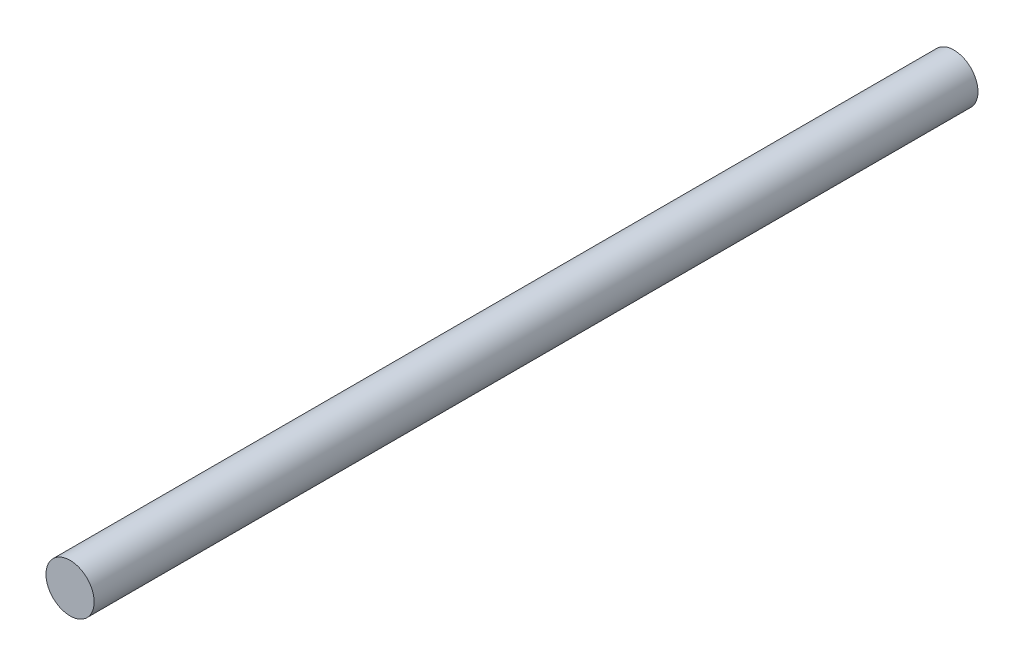
ISO-10303-21;
HEADER;
FILE_DESCRIPTION(('STEP AP214'),'2;1');
FILE_NAME('part.step','',(''),(''),'','','');
FILE_SCHEMA(('AUTOMOTIVE_DESIGN { 1 0 10303 214 1 1 1 1 }'));
ENDSEC;
DATA;
#1=APPLICATION_CONTEXT('core data for automotive mechanical design processes');
#2=APPLICATION_PROTOCOL_DEFINITION('international standard','automotive_design',2000,#1);
#3=PRODUCT_CONTEXT('',#1,'mechanical');
#4=PRODUCT('Part','Part','',(#3));
#5=PRODUCT_RELATED_PRODUCT_CATEGORY('part','',(#4));
#6=PRODUCT_DEFINITION_FORMATION('','',#4);
#7=PRODUCT_DEFINITION_CONTEXT('part definition',#1,'design');
#8=PRODUCT_DEFINITION('design','',#6,#7);
#9=PRODUCT_DEFINITION_SHAPE('','',#8);
#10=(LENGTH_UNIT() NAMED_UNIT(*) SI_UNIT(.MILLI.,.METRE.));
#11=(NAMED_UNIT(*) PLANE_ANGLE_UNIT() SI_UNIT($,.RADIAN.));
#12=(NAMED_UNIT(*) SI_UNIT($,.STERADIAN.) SOLID_ANGLE_UNIT());
#13=UNCERTAINTY_MEASURE_WITH_UNIT(LENGTH_MEASURE(1.E-05),#10,'distance_accuracy_value','');
#14=(GEOMETRIC_REPRESENTATION_CONTEXT(3) GLOBAL_UNCERTAINTY_ASSIGNED_CONTEXT((#13)) GLOBAL_UNIT_ASSIGNED_CONTEXT((#10,
#11,#12)) REPRESENTATION_CONTEXT('',''));
#15=CARTESIAN_POINT('',(0.,0.,0.));
#16=DIRECTION('',(0.,0.,1.));
#17=DIRECTION('',(1.,0.,0.));
#18=AXIS2_PLACEMENT_3D('',#15,#16,#17);
#19=CARTESIAN_POINT('',(0.,0.,55.));
#20=DIRECTION('',(0.,0.,-1.));
#21=DIRECTION('',(-1.,0.,0.));
#22=AXIS2_PLACEMENT_3D('',#19,#20,#21);
#23=CYLINDRICAL_SURFACE('',#22,1.5);
#24=CARTESIAN_POINT('',(0.,0.,55.));
#25=DIRECTION('',(0.,0.,1.));
#26=DIRECTION('',(1.,0.,0.));
#27=AXIS2_PLACEMENT_3D('',#24,#25,#26);
#28=CIRCLE('',#27,1.5);
#29=CARTESIAN_POINT('',(1.5,0.,55.));
#30=VERTEX_POINT('',#29);
#31=EDGE_CURVE('E10',#30,#30,#28,.T.);
#32=ORIENTED_EDGE('',*,*,#31,.F.);
#33=EDGE_LOOP('',(#32));
#34=FACE_BOUND('',#33,.T.);
#35=CARTESIAN_POINT('',(0.,0.,0.));
#36=DIRECTION('',(0.,0.,1.));
#37=DIRECTION('',(1.,0.,0.));
#38=AXIS2_PLACEMENT_3D('',#35,#36,#37);
#39=CIRCLE('',#38,1.5);
#40=CARTESIAN_POINT('',(1.5,0.,0.));
#41=VERTEX_POINT('',#40);
#42=EDGE_CURVE('E40',#41,#41,#39,.T.);
#43=ORIENTED_EDGE('',*,*,#42,.T.);
#44=EDGE_LOOP('',(#43));
#45=FACE_BOUND('',#44,.T.);
#46=ADVANCED_FACE('F37',(#34,#45),#23,.T.);
#47=CARTESIAN_POINT('',(0.,0.,55.));
#48=DIRECTION('',(0.,0.,1.));
#49=DIRECTION('',(1.,0.,0.));
#50=AXIS2_PLACEMENT_3D('',#47,#48,#49);
#51=PLANE('',#50);
#52=ORIENTED_EDGE('',*,*,#31,.T.);
#53=EDGE_LOOP('',(#52));
#54=FACE_BOUND('',#53,.T.);
#55=ADVANCED_FACE('F54',(#54),#51,.T.);
#56=CARTESIAN_POINT('',(0.,0.,0.));
#57=DIRECTION('',(0.,0.,1.));
#58=DIRECTION('',(1.,0.,0.));
#59=AXIS2_PLACEMENT_3D('',#56,#57,#58);
#60=PLANE('',#59);
#61=ORIENTED_EDGE('',*,*,#42,.F.);
#62=EDGE_LOOP('',(#61));
#63=FACE_BOUND('',#62,.T.);
#64=ADVANCED_FACE('F52',(#63),#60,.F.);
#65=CLOSED_SHELL('',(#46,#55,#64));
#66=MANIFOLD_SOLID_BREP('B2',#65);
#67=ADVANCED_BREP_SHAPE_REPRESENTATION('',(#18,#66),#14);
#68=SHAPE_DEFINITION_REPRESENTATION(#9,#67);
ENDSEC;
END-ISO-10303-21;
